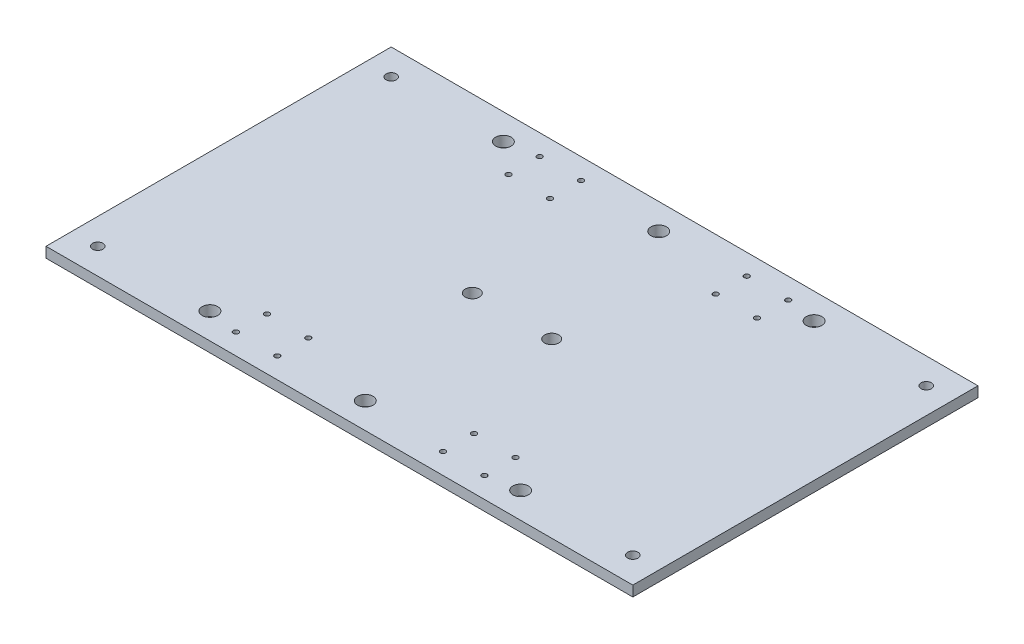
ISO-10303-21;
HEADER;
FILE_DESCRIPTION(('STEP AP214'),'2;1');
FILE_NAME('part.step','',(''),(''),'','','');
FILE_SCHEMA(('AUTOMOTIVE_DESIGN { 1 0 10303 214 1 1 1 1 }'));
ENDSEC;
DATA;
#1=APPLICATION_CONTEXT('core data for automotive mechanical design processes');
#2=APPLICATION_PROTOCOL_DEFINITION('international standard','automotive_design',2000,#1);
#3=PRODUCT_CONTEXT('',#1,'mechanical');
#4=PRODUCT('Part','Part','',(#3));
#5=PRODUCT_RELATED_PRODUCT_CATEGORY('part','',(#4));
#6=PRODUCT_DEFINITION_FORMATION('','',#4);
#7=PRODUCT_DEFINITION_CONTEXT('part definition',#1,'design');
#8=PRODUCT_DEFINITION('design','',#6,#7);
#9=PRODUCT_DEFINITION_SHAPE('','',#8);
#10=(LENGTH_UNIT() NAMED_UNIT(*) SI_UNIT(.MILLI.,.METRE.));
#11=(NAMED_UNIT(*) PLANE_ANGLE_UNIT() SI_UNIT($,.RADIAN.));
#12=(NAMED_UNIT(*) SI_UNIT($,.STERADIAN.) SOLID_ANGLE_UNIT());
#13=UNCERTAINTY_MEASURE_WITH_UNIT(LENGTH_MEASURE(1.E-05),#10,'distance_accuracy_value','');
#14=(GEOMETRIC_REPRESENTATION_CONTEXT(3) GLOBAL_UNCERTAINTY_ASSIGNED_CONTEXT((#13)) GLOBAL_UNIT_ASSIGNED_CONTEXT((#10,
#11,#12)) REPRESENTATION_CONTEXT('',''));
#15=CARTESIAN_POINT('',(0.,0.,0.));
#16=DIRECTION('',(0.,0.,1.));
#17=DIRECTION('',(1.,0.,0.));
#18=AXIS2_PLACEMENT_3D('',#15,#16,#17);
#19=CARTESIAN_POINT('',(0.,6.,0.));
#20=DIRECTION('',(0.,1.,0.));
#21=DIRECTION('',(0.,0.,1.));
#22=AXIS2_PLACEMENT_3D('',#19,#20,#21);
#23=PLANE('',#22);
#24=CARTESIAN_POINT('',(-90.,6.,85.));
#25=DIRECTION('',(0.,1.,0.));
#26=DIRECTION('',(0.,0.,1.));
#27=AXIS2_PLACEMENT_3D('',#24,#25,#26);
#28=CIRCLE('',#27,4.50000000000001);
#29=CARTESIAN_POINT('',(-90.,6.,89.5));
#30=VERTEX_POINT('',#29);
#31=EDGE_CURVE('E267',#30,#30,#28,.T.);
#32=ORIENTED_EDGE('',*,*,#31,.F.);
#33=EDGE_LOOP('',(#32));
#34=FACE_BOUND('',#33,.T.);
#35=CARTESIAN_POINT('',(90.,6.,-85.));
#36=DIRECTION('',(0.,1.,0.));
#37=DIRECTION('',(0.,0.,1.));
#38=AXIS2_PLACEMENT_3D('',#35,#36,#37);
#39=CIRCLE('',#38,4.50000000000001);
#40=CARTESIAN_POINT('',(90.,6.,-80.5));
#41=VERTEX_POINT('',#40);
#42=EDGE_CURVE('E255',#41,#41,#39,.T.);
#43=ORIENTED_EDGE('',*,*,#42,.F.);
#44=EDGE_LOOP('',(#43));
#45=FACE_BOUND('',#44,.T.);
#46=CARTESIAN_POINT('',(0.,6.,-85.));
#47=DIRECTION('',(0.,1.,0.));
#48=DIRECTION('',(0.,0.,1.));
#49=AXIS2_PLACEMENT_3D('',#46,#47,#48);
#50=CIRCLE('',#49,4.5);
#51=CARTESIAN_POINT('',(0.,6.,-80.5));
#52=VERTEX_POINT('',#51);
#53=EDGE_CURVE('E243',#52,#52,#50,.T.);
#54=ORIENTED_EDGE('',*,*,#53,.F.);
#55=EDGE_LOOP('',(#54));
#56=FACE_BOUND('',#55,.T.);
#57=CARTESIAN_POINT('',(155.,6.,85.));
#58=DIRECTION('',(0.,1.,0.));
#59=DIRECTION('',(0.,0.,-1.));
#60=AXIS2_PLACEMENT_3D('',#57,#58,#59);
#61=CIRCLE('',#60,2.99999999999999);
#62=CARTESIAN_POINT('',(155.,6.,82.));
#63=VERTEX_POINT('',#62);
#64=EDGE_CURVE('E231',#63,#63,#61,.T.);
#65=ORIENTED_EDGE('',*,*,#64,.F.);
#66=EDGE_LOOP('',(#65));
#67=FACE_BOUND('',#66,.T.);
#68=CARTESIAN_POINT('',(155.,6.,-85.));
#69=DIRECTION('',(0.,1.,0.));
#70=DIRECTION('',(0.,0.,1.));
#71=AXIS2_PLACEMENT_3D('',#68,#69,#70);
#72=CIRCLE('',#71,2.99999999999999);
#73=CARTESIAN_POINT('',(155.,6.,-82.));
#74=VERTEX_POINT('',#73);
#75=EDGE_CURVE('E219',#74,#74,#72,.T.);
#76=ORIENTED_EDGE('',*,*,#75,.F.);
#77=EDGE_LOOP('',(#76));
#78=FACE_BOUND('',#77,.T.);
#79=CARTESIAN_POINT('',(48.,6.,88.));
#80=DIRECTION('',(0.,1.,0.));
#81=DIRECTION('',(0.,0.,1.));
#82=AXIS2_PLACEMENT_3D('',#79,#80,#81);
#83=CIRCLE('',#82,1.49999999999333);
#84=CARTESIAN_POINT('',(48.,6.,89.4999999999933));
#85=VERTEX_POINT('',#84);
#86=EDGE_CURVE('E207',#85,#85,#83,.T.);
#87=ORIENTED_EDGE('',*,*,#86,.F.);
#88=EDGE_LOOP('',(#87));
#89=FACE_BOUND('',#88,.T.);
#90=CARTESIAN_POINT('',(48.0000000000002,6.,70.));
#91=DIRECTION('',(0.,1.,0.));
#92=DIRECTION('',(0.,0.,1.));
#93=AXIS2_PLACEMENT_3D('',#90,#91,#92);
#94=CIRCLE('',#93,1.49999999999333);
#95=CARTESIAN_POINT('',(48.0000000000002,6.,71.4999999999933));
#96=VERTEX_POINT('',#95);
#97=EDGE_CURVE('E195',#96,#96,#94,.T.);
#98=ORIENTED_EDGE('',*,*,#97,.F.);
#99=EDGE_LOOP('',(#98));
#100=FACE_BOUND('',#99,.T.);
#101=CARTESIAN_POINT('',(-72.0000000000007,6.,69.9999999999996));
#102=DIRECTION('',(0.,1.,0.));
#103=DIRECTION('',(0.,0.,1.));
#104=AXIS2_PLACEMENT_3D('',#101,#102,#103);
#105=CIRCLE('',#104,1.5);
#106=CARTESIAN_POINT('',(-72.0000000000007,6.,71.4999999999996));
#107=VERTEX_POINT('',#106);
#108=EDGE_CURVE('E183',#107,#107,#105,.T.);
#109=ORIENTED_EDGE('',*,*,#108,.F.);
#110=EDGE_LOOP('',(#109));
#111=FACE_BOUND('',#110,.T.);
#112=CARTESIAN_POINT('',(-72.0000000000006,6.,87.9999999999996));
#113=DIRECTION('',(0.,1.,0.));
#114=DIRECTION('',(0.,0.,1.));
#115=AXIS2_PLACEMENT_3D('',#112,#113,#114);
#116=CIRCLE('',#115,1.5);
#117=CARTESIAN_POINT('',(-72.0000000000006,6.,89.4999999999996));
#118=VERTEX_POINT('',#117);
#119=EDGE_CURVE('E171',#118,#118,#116,.T.);
#120=ORIENTED_EDGE('',*,*,#119,.F.);
#121=EDGE_LOOP('',(#120));
#122=FACE_BOUND('',#121,.T.);
#123=CARTESIAN_POINT('',(-48.0000000000006,6.,-87.9999999999996));
#124=DIRECTION('',(0.,1.,0.));
#125=DIRECTION('',(0.,0.,1.));
#126=AXIS2_PLACEMENT_3D('',#123,#124,#125);
#127=CIRCLE('',#126,1.49999999999332);
#128=CARTESIAN_POINT('',(-48.0000000000006,6.,-86.5000000000063));
#129=VERTEX_POINT('',#128);
#130=EDGE_CURVE('E159',#129,#129,#127,.T.);
#131=ORIENTED_EDGE('',*,*,#130,.F.);
#132=EDGE_LOOP('',(#131));
#133=FACE_BOUND('',#132,.T.);
#134=CARTESIAN_POINT('',(-48.0000000000007,6.,-69.9999999999996));
#135=DIRECTION('',(0.,1.,0.));
#136=DIRECTION('',(0.,0.,1.));
#137=AXIS2_PLACEMENT_3D('',#134,#135,#136);
#138=CIRCLE('',#137,1.49999999999332);
#139=CARTESIAN_POINT('',(-48.0000000000007,6.,-68.5000000000063));
#140=VERTEX_POINT('',#139);
#141=EDGE_CURVE('E147',#140,#140,#138,.T.);
#142=ORIENTED_EDGE('',*,*,#141,.F.);
#143=EDGE_LOOP('',(#142));
#144=FACE_BOUND('',#143,.T.);
#145=CARTESIAN_POINT('',(72.0000000000002,6.,-70.));
#146=DIRECTION('',(0.,1.,0.));
#147=DIRECTION('',(0.,0.,1.));
#148=AXIS2_PLACEMENT_3D('',#145,#146,#147);
#149=CIRCLE('',#148,1.5);
#150=CARTESIAN_POINT('',(72.0000000000002,6.,-68.5));
#151=VERTEX_POINT('',#150);
#152=EDGE_CURVE('E135',#151,#151,#149,.T.);
#153=ORIENTED_EDGE('',*,*,#152,.F.);
#154=EDGE_LOOP('',(#153));
#155=FACE_BOUND('',#154,.T.);
#156=CARTESIAN_POINT('',(72.,6.,-88.));
#157=DIRECTION('',(0.,1.,0.));
#158=DIRECTION('',(0.,0.,1.));
#159=AXIS2_PLACEMENT_3D('',#156,#157,#158);
#160=CIRCLE('',#159,1.5);
#161=CARTESIAN_POINT('',(72.,6.,-86.5));
#162=VERTEX_POINT('',#161);
#163=EDGE_CURVE('E123',#162,#162,#160,.T.);
#164=ORIENTED_EDGE('',*,*,#163,.F.);
#165=EDGE_LOOP('',(#164));
#166=FACE_BOUND('',#165,.T.);
#167=CARTESIAN_POINT('',(-23.,6.,0.));
#168=DIRECTION('',(0.,1.,0.));
#169=DIRECTION('',(0.,0.,1.));
#170=AXIS2_PLACEMENT_3D('',#167,#168,#169);
#171=CIRCLE('',#170,4.1);
#172=CARTESIAN_POINT('',(-23.,6.,4.1));
#173=VERTEX_POINT('',#172);
#174=EDGE_CURVE('E102',#173,#173,#171,.T.);
#175=ORIENTED_EDGE('',*,*,#174,.F.);
#176=EDGE_LOOP('',(#175));
#177=FACE_BOUND('',#176,.T.);
#178=DIRECTION('',(0.,0.,-1.));
#179=VECTOR('',#178,1.);
#180=CARTESIAN_POINT('',(170.,6.,-100.));
#181=LINE('',#180,#179);
#182=CARTESIAN_POINT('',(170.,6.,100.));
#183=VERTEX_POINT('',#182);
#184=CARTESIAN_POINT('',(170.,6.,-100.));
#185=VERTEX_POINT('',#184);
#186=EDGE_CURVE('E87',#183,#185,#181,.T.);
#187=ORIENTED_EDGE('',*,*,#186,.T.);
#188=DIRECTION('',(-1.,0.,0.));
#189=VECTOR('',#188,1.);
#190=CARTESIAN_POINT('',(-170.,6.,-100.));
#191=LINE('',#190,#189);
#192=CARTESIAN_POINT('',(-170.,6.,-100.));
#193=VERTEX_POINT('',#192);
#194=EDGE_CURVE('E82',#185,#193,#191,.T.);
#195=ORIENTED_EDGE('',*,*,#194,.T.);
#196=DIRECTION('',(0.,0.,1.));
#197=VECTOR('',#196,1.);
#198=CARTESIAN_POINT('',(-170.,6.,-100.));
#199=LINE('',#198,#197);
#200=CARTESIAN_POINT('',(-170.,6.,100.));
#201=VERTEX_POINT('',#200);
#202=EDGE_CURVE('E85',#193,#201,#199,.T.);
#203=ORIENTED_EDGE('',*,*,#202,.T.);
#204=DIRECTION('',(1.,0.,0.));
#205=VECTOR('',#204,1.);
#206=CARTESIAN_POINT('',(-170.,6.,100.));
#207=LINE('',#206,#205);
#208=EDGE_CURVE('E52',#201,#183,#207,.T.);
#209=ORIENTED_EDGE('',*,*,#208,.T.);
#210=EDGE_LOOP('',(#187,#195,#203,#209));
#211=FACE_BOUND('',#210,.T.);
#212=CARTESIAN_POINT('',(23.,6.,0.));
#213=DIRECTION('',(0.,1.,0.));
#214=DIRECTION('',(0.,0.,-1.));
#215=AXIS2_PLACEMENT_3D('',#212,#213,#214);
#216=CIRCLE('',#215,4.10000000000001);
#217=CARTESIAN_POINT('',(23.,6.,-4.10000000000001));
#218=VERTEX_POINT('',#217);
#219=EDGE_CURVE('E117',#218,#218,#216,.T.);
#220=ORIENTED_EDGE('',*,*,#219,.F.);
#221=EDGE_LOOP('',(#220));
#222=FACE_BOUND('',#221,.T.);
#223=CARTESIAN_POINT('',(48.,6.,-88.));
#224=DIRECTION('',(0.,1.,0.));
#225=DIRECTION('',(0.,0.,-1.));
#226=AXIS2_PLACEMENT_3D('',#223,#224,#225);
#227=CIRCLE('',#226,1.49999999999333);
#228=CARTESIAN_POINT('',(48.,6.,-89.4999999999933));
#229=VERTEX_POINT('',#228);
#230=EDGE_CURVE('E129',#229,#229,#227,.T.);
#231=ORIENTED_EDGE('',*,*,#230,.F.);
#232=EDGE_LOOP('',(#231));
#233=FACE_BOUND('',#232,.T.);
#234=CARTESIAN_POINT('',(48.0000000000002,6.,-70.));
#235=DIRECTION('',(0.,1.,0.));
#236=DIRECTION('',(0.,0.,-1.));
#237=AXIS2_PLACEMENT_3D('',#234,#235,#236);
#238=CIRCLE('',#237,1.49999999999333);
#239=CARTESIAN_POINT('',(48.0000000000002,6.,-71.4999999999933));
#240=VERTEX_POINT('',#239);
#241=EDGE_CURVE('E141',#240,#240,#238,.T.);
#242=ORIENTED_EDGE('',*,*,#241,.F.);
#243=EDGE_LOOP('',(#242));
#244=FACE_BOUND('',#243,.T.);
#245=CARTESIAN_POINT('',(-72.0000000000007,6.,-69.9999999999996));
#246=DIRECTION('',(0.,1.,0.));
#247=DIRECTION('',(0.,0.,-1.));
#248=AXIS2_PLACEMENT_3D('',#245,#246,#247);
#249=CIRCLE('',#248,1.5);
#250=CARTESIAN_POINT('',(-72.0000000000007,6.,-71.4999999999996));
#251=VERTEX_POINT('',#250);
#252=EDGE_CURVE('E153',#251,#251,#249,.T.);
#253=ORIENTED_EDGE('',*,*,#252,.F.);
#254=EDGE_LOOP('',(#253));
#255=FACE_BOUND('',#254,.T.);
#256=CARTESIAN_POINT('',(-72.0000000000006,6.,-87.9999999999996));
#257=DIRECTION('',(0.,1.,0.));
#258=DIRECTION('',(0.,0.,-1.));
#259=AXIS2_PLACEMENT_3D('',#256,#257,#258);
#260=CIRCLE('',#259,1.5);
#261=CARTESIAN_POINT('',(-72.0000000000006,6.,-89.4999999999996));
#262=VERTEX_POINT('',#261);
#263=EDGE_CURVE('E165',#262,#262,#260,.T.);
#264=ORIENTED_EDGE('',*,*,#263,.F.);
#265=EDGE_LOOP('',(#264));
#266=FACE_BOUND('',#265,.T.);
#267=CARTESIAN_POINT('',(-48.0000000000006,6.,87.9999999999996));
#268=DIRECTION('',(0.,1.,0.));
#269=DIRECTION('',(0.,0.,-1.));
#270=AXIS2_PLACEMENT_3D('',#267,#268,#269);
#271=CIRCLE('',#270,1.49999999999332);
#272=CARTESIAN_POINT('',(-48.0000000000006,6.,86.5000000000063));
#273=VERTEX_POINT('',#272);
#274=EDGE_CURVE('E177',#273,#273,#271,.T.);
#275=ORIENTED_EDGE('',*,*,#274,.F.);
#276=EDGE_LOOP('',(#275));
#277=FACE_BOUND('',#276,.T.);
#278=CARTESIAN_POINT('',(-48.0000000000007,6.,69.9999999999996));
#279=DIRECTION('',(0.,1.,0.));
#280=DIRECTION('',(0.,0.,-1.));
#281=AXIS2_PLACEMENT_3D('',#278,#279,#280);
#282=CIRCLE('',#281,1.49999999999332);
#283=CARTESIAN_POINT('',(-48.0000000000007,6.,68.5000000000063));
#284=VERTEX_POINT('',#283);
#285=EDGE_CURVE('E189',#284,#284,#282,.T.);
#286=ORIENTED_EDGE('',*,*,#285,.F.);
#287=EDGE_LOOP('',(#286));
#288=FACE_BOUND('',#287,.T.);
#289=CARTESIAN_POINT('',(72.0000000000002,6.,70.));
#290=DIRECTION('',(0.,1.,0.));
#291=DIRECTION('',(0.,0.,-1.));
#292=AXIS2_PLACEMENT_3D('',#289,#290,#291);
#293=CIRCLE('',#292,1.5);
#294=CARTESIAN_POINT('',(72.0000000000002,6.,68.5));
#295=VERTEX_POINT('',#294);
#296=EDGE_CURVE('E201',#295,#295,#293,.T.);
#297=ORIENTED_EDGE('',*,*,#296,.F.);
#298=EDGE_LOOP('',(#297));
#299=FACE_BOUND('',#298,.T.);
#300=CARTESIAN_POINT('',(72.,6.,88.));
#301=DIRECTION('',(0.,1.,0.));
#302=DIRECTION('',(0.,0.,-1.));
#303=AXIS2_PLACEMENT_3D('',#300,#301,#302);
#304=CIRCLE('',#303,1.5);
#305=CARTESIAN_POINT('',(72.,6.,86.5));
#306=VERTEX_POINT('',#305);
#307=EDGE_CURVE('E213',#306,#306,#304,.T.);
#308=ORIENTED_EDGE('',*,*,#307,.F.);
#309=EDGE_LOOP('',(#308));
#310=FACE_BOUND('',#309,.T.);
#311=CARTESIAN_POINT('',(-155.,6.,-85.));
#312=DIRECTION('',(0.,1.,0.));
#313=DIRECTION('',(0.,0.,-1.));
#314=AXIS2_PLACEMENT_3D('',#311,#312,#313);
#315=CIRCLE('',#314,2.99999999999999);
#316=CARTESIAN_POINT('',(-155.,6.,-88.));
#317=VERTEX_POINT('',#316);
#318=EDGE_CURVE('E225',#317,#317,#315,.T.);
#319=ORIENTED_EDGE('',*,*,#318,.F.);
#320=EDGE_LOOP('',(#319));
#321=FACE_BOUND('',#320,.T.);
#322=CARTESIAN_POINT('',(-155.,6.,85.));
#323=DIRECTION('',(0.,1.,0.));
#324=DIRECTION('',(0.,0.,1.));
#325=AXIS2_PLACEMENT_3D('',#322,#323,#324);
#326=CIRCLE('',#325,2.99999999999999);
#327=CARTESIAN_POINT('',(-155.,6.,88.));
#328=VERTEX_POINT('',#327);
#329=EDGE_CURVE('E237',#328,#328,#326,.T.);
#330=ORIENTED_EDGE('',*,*,#329,.F.);
#331=EDGE_LOOP('',(#330));
#332=FACE_BOUND('',#331,.T.);
#333=CARTESIAN_POINT('',(0.,6.,85.));
#334=DIRECTION('',(0.,1.,0.));
#335=DIRECTION('',(0.,0.,-1.));
#336=AXIS2_PLACEMENT_3D('',#333,#334,#335);
#337=CIRCLE('',#336,4.5);
#338=CARTESIAN_POINT('',(0.,6.,80.5));
#339=VERTEX_POINT('',#338);
#340=EDGE_CURVE('E249',#339,#339,#337,.T.);
#341=ORIENTED_EDGE('',*,*,#340,.F.);
#342=EDGE_LOOP('',(#341));
#343=FACE_BOUND('',#342,.T.);
#344=CARTESIAN_POINT('',(90.,6.,85.));
#345=DIRECTION('',(0.,1.,0.));
#346=DIRECTION('',(0.,0.,-1.));
#347=AXIS2_PLACEMENT_3D('',#344,#345,#346);
#348=CIRCLE('',#347,4.50000000000001);
#349=CARTESIAN_POINT('',(90.,6.,80.5));
#350=VERTEX_POINT('',#349);
#351=EDGE_CURVE('E261',#350,#350,#348,.T.);
#352=ORIENTED_EDGE('',*,*,#351,.F.);
#353=EDGE_LOOP('',(#352));
#354=FACE_BOUND('',#353,.T.);
#355=CARTESIAN_POINT('',(-90.,6.,-85.));
#356=DIRECTION('',(0.,1.,0.));
#357=DIRECTION('',(0.,0.,-1.));
#358=AXIS2_PLACEMENT_3D('',#355,#356,#357);
#359=CIRCLE('',#358,4.50000000000001);
#360=CARTESIAN_POINT('',(-90.,6.,-89.5));
#361=VERTEX_POINT('',#360);
#362=EDGE_CURVE('E273',#361,#361,#359,.T.);
#363=ORIENTED_EDGE('',*,*,#362,.F.);
#364=EDGE_LOOP('',(#363));
#365=FACE_BOUND('',#364,.T.);
#366=ADVANCED_FACE('F35',(#34,#45,#56,#67,#78,#89,#100,#111,#122,#133,#144,#155,#166,#177,#211,
#222,#233,#244,#255,#266,#277,#288,#299,#310,#321,#332,#343,#354,#365),#23,.T.);
#367=CARTESIAN_POINT('',(0.,0.,0.));
#368=DIRECTION('',(0.,1.,0.));
#369=DIRECTION('',(0.,0.,1.));
#370=AXIS2_PLACEMENT_3D('',#367,#368,#369);
#371=PLANE('',#370);
#372=DIRECTION('',(0.,0.,-1.));
#373=VECTOR('',#372,1.);
#374=CARTESIAN_POINT('',(170.,0.,-100.));
#375=LINE('',#374,#373);
#376=CARTESIAN_POINT('',(170.,0.,100.));
#377=VERTEX_POINT('',#376);
#378=CARTESIAN_POINT('',(170.,0.,-100.));
#379=VERTEX_POINT('',#378);
#380=EDGE_CURVE('E99',#377,#379,#375,.T.);
#381=ORIENTED_EDGE('',*,*,#380,.F.);
#382=DIRECTION('',(1.,0.,0.));
#383=VECTOR('',#382,1.);
#384=CARTESIAN_POINT('',(-170.,0.,100.));
#385=LINE('',#384,#383);
#386=CARTESIAN_POINT('',(-170.,0.,100.));
#387=VERTEX_POINT('',#386);
#388=EDGE_CURVE('E75',#387,#377,#385,.T.);
#389=ORIENTED_EDGE('',*,*,#388,.F.);
#390=DIRECTION('',(0.,0.,1.));
#391=VECTOR('',#390,1.);
#392=CARTESIAN_POINT('',(-170.,0.,-100.));
#393=LINE('',#392,#391);
#394=CARTESIAN_POINT('',(-170.,0.,-100.));
#395=VERTEX_POINT('',#394);
#396=EDGE_CURVE('E69',#395,#387,#393,.T.);
#397=ORIENTED_EDGE('',*,*,#396,.F.);
#398=DIRECTION('',(-1.,0.,0.));
#399=VECTOR('',#398,1.);
#400=CARTESIAN_POINT('',(-170.,0.,-100.));
#401=LINE('',#400,#399);
#402=EDGE_CURVE('E91',#379,#395,#401,.T.);
#403=ORIENTED_EDGE('',*,*,#402,.F.);
#404=EDGE_LOOP('',(#381,#389,#397,#403));
#405=FACE_BOUND('',#404,.T.);
#406=CARTESIAN_POINT('',(-23.,0.,0.));
#407=DIRECTION('',(0.,1.,0.));
#408=DIRECTION('',(0.,0.,1.));
#409=AXIS2_PLACEMENT_3D('',#406,#407,#408);
#410=CIRCLE('',#409,4.1);
#411=CARTESIAN_POINT('',(-23.,0.,4.1));
#412=VERTEX_POINT('',#411);
#413=EDGE_CURVE('E114',#412,#412,#410,.T.);
#414=ORIENTED_EDGE('',*,*,#413,.T.);
#415=EDGE_LOOP('',(#414));
#416=FACE_BOUND('',#415,.T.);
#417=CARTESIAN_POINT('',(23.,0.,0.));
#418=DIRECTION('',(0.,1.,0.));
#419=DIRECTION('',(0.,0.,-1.));
#420=AXIS2_PLACEMENT_3D('',#417,#418,#419);
#421=CIRCLE('',#420,4.10000000000001);
#422=CARTESIAN_POINT('',(23.,0.,-4.10000000000001));
#423=VERTEX_POINT('',#422);
#424=EDGE_CURVE('E120',#423,#423,#421,.T.);
#425=ORIENTED_EDGE('',*,*,#424,.T.);
#426=EDGE_LOOP('',(#425));
#427=FACE_BOUND('',#426,.T.);
#428=CARTESIAN_POINT('',(72.,0.,-88.));
#429=DIRECTION('',(0.,1.,0.));
#430=DIRECTION('',(0.,0.,1.));
#431=AXIS2_PLACEMENT_3D('',#428,#429,#430);
#432=CIRCLE('',#431,1.5);
#433=CARTESIAN_POINT('',(72.,0.,-86.5));
#434=VERTEX_POINT('',#433);
#435=EDGE_CURVE('E126',#434,#434,#432,.T.);
#436=ORIENTED_EDGE('',*,*,#435,.T.);
#437=EDGE_LOOP('',(#436));
#438=FACE_BOUND('',#437,.T.);
#439=CARTESIAN_POINT('',(48.,0.,-88.));
#440=DIRECTION('',(0.,1.,0.));
#441=DIRECTION('',(0.,0.,-1.));
#442=AXIS2_PLACEMENT_3D('',#439,#440,#441);
#443=CIRCLE('',#442,1.49999999999333);
#444=CARTESIAN_POINT('',(48.,0.,-89.4999999999933));
#445=VERTEX_POINT('',#444);
#446=EDGE_CURVE('E132',#445,#445,#443,.T.);
#447=ORIENTED_EDGE('',*,*,#446,.T.);
#448=EDGE_LOOP('',(#447));
#449=FACE_BOUND('',#448,.T.);
#450=CARTESIAN_POINT('',(72.0000000000002,0.,-70.));
#451=DIRECTION('',(0.,1.,0.));
#452=DIRECTION('',(0.,0.,1.));
#453=AXIS2_PLACEMENT_3D('',#450,#451,#452);
#454=CIRCLE('',#453,1.5);
#455=CARTESIAN_POINT('',(72.0000000000002,0.,-68.5));
#456=VERTEX_POINT('',#455);
#457=EDGE_CURVE('E138',#456,#456,#454,.T.);
#458=ORIENTED_EDGE('',*,*,#457,.T.);
#459=EDGE_LOOP('',(#458));
#460=FACE_BOUND('',#459,.T.);
#461=CARTESIAN_POINT('',(48.0000000000002,0.,-70.));
#462=DIRECTION('',(0.,1.,0.));
#463=DIRECTION('',(0.,0.,-1.));
#464=AXIS2_PLACEMENT_3D('',#461,#462,#463);
#465=CIRCLE('',#464,1.49999999999333);
#466=CARTESIAN_POINT('',(48.0000000000002,0.,-71.4999999999933));
#467=VERTEX_POINT('',#466);
#468=EDGE_CURVE('E144',#467,#467,#465,.T.);
#469=ORIENTED_EDGE('',*,*,#468,.T.);
#470=EDGE_LOOP('',(#469));
#471=FACE_BOUND('',#470,.T.);
#472=CARTESIAN_POINT('',(-48.0000000000007,0.,-69.9999999999996));
#473=DIRECTION('',(0.,1.,0.));
#474=DIRECTION('',(0.,0.,1.));
#475=AXIS2_PLACEMENT_3D('',#472,#473,#474);
#476=CIRCLE('',#475,1.49999999999332);
#477=CARTESIAN_POINT('',(-48.0000000000007,0.,-68.5000000000063));
#478=VERTEX_POINT('',#477);
#479=EDGE_CURVE('E150',#478,#478,#476,.T.);
#480=ORIENTED_EDGE('',*,*,#479,.T.);
#481=EDGE_LOOP('',(#480));
#482=FACE_BOUND('',#481,.T.);
#483=CARTESIAN_POINT('',(-72.0000000000007,0.,-69.9999999999996));
#484=DIRECTION('',(0.,1.,0.));
#485=DIRECTION('',(0.,0.,-1.));
#486=AXIS2_PLACEMENT_3D('',#483,#484,#485);
#487=CIRCLE('',#486,1.5);
#488=CARTESIAN_POINT('',(-72.0000000000007,0.,-71.4999999999996));
#489=VERTEX_POINT('',#488);
#490=EDGE_CURVE('E156',#489,#489,#487,.T.);
#491=ORIENTED_EDGE('',*,*,#490,.T.);
#492=EDGE_LOOP('',(#491));
#493=FACE_BOUND('',#492,.T.);
#494=CARTESIAN_POINT('',(-48.0000000000006,0.,-87.9999999999996));
#495=DIRECTION('',(0.,1.,0.));
#496=DIRECTION('',(0.,0.,1.));
#497=AXIS2_PLACEMENT_3D('',#494,#495,#496);
#498=CIRCLE('',#497,1.49999999999332);
#499=CARTESIAN_POINT('',(-48.0000000000006,0.,-86.5000000000063));
#500=VERTEX_POINT('',#499);
#501=EDGE_CURVE('E162',#500,#500,#498,.T.);
#502=ORIENTED_EDGE('',*,*,#501,.T.);
#503=EDGE_LOOP('',(#502));
#504=FACE_BOUND('',#503,.T.);
#505=CARTESIAN_POINT('',(-72.0000000000006,0.,-87.9999999999996));
#506=DIRECTION('',(0.,1.,0.));
#507=DIRECTION('',(0.,0.,-1.));
#508=AXIS2_PLACEMENT_3D('',#505,#506,#507);
#509=CIRCLE('',#508,1.5);
#510=CARTESIAN_POINT('',(-72.0000000000006,0.,-89.4999999999996));
#511=VERTEX_POINT('',#510);
#512=EDGE_CURVE('E168',#511,#511,#509,.T.);
#513=ORIENTED_EDGE('',*,*,#512,.T.);
#514=EDGE_LOOP('',(#513));
#515=FACE_BOUND('',#514,.T.);
#516=CARTESIAN_POINT('',(-72.0000000000006,0.,87.9999999999996));
#517=DIRECTION('',(0.,1.,0.));
#518=DIRECTION('',(0.,0.,1.));
#519=AXIS2_PLACEMENT_3D('',#516,#517,#518);
#520=CIRCLE('',#519,1.5);
#521=CARTESIAN_POINT('',(-72.0000000000006,0.,89.4999999999996));
#522=VERTEX_POINT('',#521);
#523=EDGE_CURVE('E174',#522,#522,#520,.T.);
#524=ORIENTED_EDGE('',*,*,#523,.T.);
#525=EDGE_LOOP('',(#524));
#526=FACE_BOUND('',#525,.T.);
#527=CARTESIAN_POINT('',(-48.0000000000006,0.,87.9999999999996));
#528=DIRECTION('',(0.,1.,0.));
#529=DIRECTION('',(0.,0.,-1.));
#530=AXIS2_PLACEMENT_3D('',#527,#528,#529);
#531=CIRCLE('',#530,1.49999999999332);
#532=CARTESIAN_POINT('',(-48.0000000000006,0.,86.5000000000063));
#533=VERTEX_POINT('',#532);
#534=EDGE_CURVE('E180',#533,#533,#531,.T.);
#535=ORIENTED_EDGE('',*,*,#534,.T.);
#536=EDGE_LOOP('',(#535));
#537=FACE_BOUND('',#536,.T.);
#538=CARTESIAN_POINT('',(-72.0000000000007,0.,69.9999999999996));
#539=DIRECTION('',(0.,1.,0.));
#540=DIRECTION('',(0.,0.,1.));
#541=AXIS2_PLACEMENT_3D('',#538,#539,#540);
#542=CIRCLE('',#541,1.5);
#543=CARTESIAN_POINT('',(-72.0000000000007,0.,71.4999999999996));
#544=VERTEX_POINT('',#543);
#545=EDGE_CURVE('E186',#544,#544,#542,.T.);
#546=ORIENTED_EDGE('',*,*,#545,.T.);
#547=EDGE_LOOP('',(#546));
#548=FACE_BOUND('',#547,.T.);
#549=CARTESIAN_POINT('',(-48.0000000000007,0.,69.9999999999996));
#550=DIRECTION('',(0.,1.,0.));
#551=DIRECTION('',(0.,0.,-1.));
#552=AXIS2_PLACEMENT_3D('',#549,#550,#551);
#553=CIRCLE('',#552,1.49999999999332);
#554=CARTESIAN_POINT('',(-48.0000000000007,0.,68.5000000000063));
#555=VERTEX_POINT('',#554);
#556=EDGE_CURVE('E192',#555,#555,#553,.T.);
#557=ORIENTED_EDGE('',*,*,#556,.T.);
#558=EDGE_LOOP('',(#557));
#559=FACE_BOUND('',#558,.T.);
#560=CARTESIAN_POINT('',(48.0000000000002,0.,70.));
#561=DIRECTION('',(0.,1.,0.));
#562=DIRECTION('',(0.,0.,1.));
#563=AXIS2_PLACEMENT_3D('',#560,#561,#562);
#564=CIRCLE('',#563,1.49999999999333);
#565=CARTESIAN_POINT('',(48.0000000000002,0.,71.4999999999933));
#566=VERTEX_POINT('',#565);
#567=EDGE_CURVE('E198',#566,#566,#564,.T.);
#568=ORIENTED_EDGE('',*,*,#567,.T.);
#569=EDGE_LOOP('',(#568));
#570=FACE_BOUND('',#569,.T.);
#571=CARTESIAN_POINT('',(72.0000000000002,0.,70.));
#572=DIRECTION('',(0.,1.,0.));
#573=DIRECTION('',(0.,0.,-1.));
#574=AXIS2_PLACEMENT_3D('',#571,#572,#573);
#575=CIRCLE('',#574,1.5);
#576=CARTESIAN_POINT('',(72.0000000000002,0.,68.5));
#577=VERTEX_POINT('',#576);
#578=EDGE_CURVE('E204',#577,#577,#575,.T.);
#579=ORIENTED_EDGE('',*,*,#578,.T.);
#580=EDGE_LOOP('',(#579));
#581=FACE_BOUND('',#580,.T.);
#582=CARTESIAN_POINT('',(48.,0.,88.));
#583=DIRECTION('',(0.,1.,0.));
#584=DIRECTION('',(0.,0.,1.));
#585=AXIS2_PLACEMENT_3D('',#582,#583,#584);
#586=CIRCLE('',#585,1.49999999999333);
#587=CARTESIAN_POINT('',(48.,0.,89.4999999999933));
#588=VERTEX_POINT('',#587);
#589=EDGE_CURVE('E210',#588,#588,#586,.T.);
#590=ORIENTED_EDGE('',*,*,#589,.T.);
#591=EDGE_LOOP('',(#590));
#592=FACE_BOUND('',#591,.T.);
#593=CARTESIAN_POINT('',(72.,0.,88.));
#594=DIRECTION('',(0.,1.,0.));
#595=DIRECTION('',(0.,0.,-1.));
#596=AXIS2_PLACEMENT_3D('',#593,#594,#595);
#597=CIRCLE('',#596,1.5);
#598=CARTESIAN_POINT('',(72.,0.,86.5));
#599=VERTEX_POINT('',#598);
#600=EDGE_CURVE('E216',#599,#599,#597,.T.);
#601=ORIENTED_EDGE('',*,*,#600,.T.);
#602=EDGE_LOOP('',(#601));
#603=FACE_BOUND('',#602,.T.);
#604=CARTESIAN_POINT('',(155.,0.,-85.));
#605=DIRECTION('',(0.,1.,0.));
#606=DIRECTION('',(0.,0.,1.));
#607=AXIS2_PLACEMENT_3D('',#604,#605,#606);
#608=CIRCLE('',#607,2.99999999999999);
#609=CARTESIAN_POINT('',(155.,0.,-82.));
#610=VERTEX_POINT('',#609);
#611=EDGE_CURVE('E222',#610,#610,#608,.T.);
#612=ORIENTED_EDGE('',*,*,#611,.T.);
#613=EDGE_LOOP('',(#612));
#614=FACE_BOUND('',#613,.T.);
#615=CARTESIAN_POINT('',(-155.,0.,-85.));
#616=DIRECTION('',(0.,1.,0.));
#617=DIRECTION('',(0.,0.,-1.));
#618=AXIS2_PLACEMENT_3D('',#615,#616,#617);
#619=CIRCLE('',#618,2.99999999999999);
#620=CARTESIAN_POINT('',(-155.,0.,-88.));
#621=VERTEX_POINT('',#620);
#622=EDGE_CURVE('E228',#621,#621,#619,.T.);
#623=ORIENTED_EDGE('',*,*,#622,.T.);
#624=EDGE_LOOP('',(#623));
#625=FACE_BOUND('',#624,.T.);
#626=CARTESIAN_POINT('',(155.,0.,85.));
#627=DIRECTION('',(0.,1.,0.));
#628=DIRECTION('',(0.,0.,-1.));
#629=AXIS2_PLACEMENT_3D('',#626,#627,#628);
#630=CIRCLE('',#629,2.99999999999999);
#631=CARTESIAN_POINT('',(155.,0.,82.));
#632=VERTEX_POINT('',#631);
#633=EDGE_CURVE('E234',#632,#632,#630,.T.);
#634=ORIENTED_EDGE('',*,*,#633,.T.);
#635=EDGE_LOOP('',(#634));
#636=FACE_BOUND('',#635,.T.);
#637=CARTESIAN_POINT('',(-155.,0.,85.));
#638=DIRECTION('',(0.,1.,0.));
#639=DIRECTION('',(0.,0.,1.));
#640=AXIS2_PLACEMENT_3D('',#637,#638,#639);
#641=CIRCLE('',#640,2.99999999999999);
#642=CARTESIAN_POINT('',(-155.,0.,88.));
#643=VERTEX_POINT('',#642);
#644=EDGE_CURVE('E240',#643,#643,#641,.T.);
#645=ORIENTED_EDGE('',*,*,#644,.T.);
#646=EDGE_LOOP('',(#645));
#647=FACE_BOUND('',#646,.T.);
#648=CARTESIAN_POINT('',(0.,0.,-85.));
#649=DIRECTION('',(0.,1.,0.));
#650=DIRECTION('',(0.,0.,1.));
#651=AXIS2_PLACEMENT_3D('',#648,#649,#650);
#652=CIRCLE('',#651,4.5);
#653=CARTESIAN_POINT('',(0.,0.,-80.5));
#654=VERTEX_POINT('',#653);
#655=EDGE_CURVE('E246',#654,#654,#652,.T.);
#656=ORIENTED_EDGE('',*,*,#655,.T.);
#657=EDGE_LOOP('',(#656));
#658=FACE_BOUND('',#657,.T.);
#659=CARTESIAN_POINT('',(0.,0.,85.));
#660=DIRECTION('',(0.,1.,0.));
#661=DIRECTION('',(0.,0.,-1.));
#662=AXIS2_PLACEMENT_3D('',#659,#660,#661);
#663=CIRCLE('',#662,4.5);
#664=CARTESIAN_POINT('',(0.,0.,80.5));
#665=VERTEX_POINT('',#664);
#666=EDGE_CURVE('E252',#665,#665,#663,.T.);
#667=ORIENTED_EDGE('',*,*,#666,.T.);
#668=EDGE_LOOP('',(#667));
#669=FACE_BOUND('',#668,.T.);
#670=CARTESIAN_POINT('',(90.,0.,-85.));
#671=DIRECTION('',(0.,1.,0.));
#672=DIRECTION('',(0.,0.,1.));
#673=AXIS2_PLACEMENT_3D('',#670,#671,#672);
#674=CIRCLE('',#673,4.50000000000001);
#675=CARTESIAN_POINT('',(90.,0.,-80.5));
#676=VERTEX_POINT('',#675);
#677=EDGE_CURVE('E258',#676,#676,#674,.T.);
#678=ORIENTED_EDGE('',*,*,#677,.T.);
#679=EDGE_LOOP('',(#678));
#680=FACE_BOUND('',#679,.T.);
#681=CARTESIAN_POINT('',(90.,0.,85.));
#682=DIRECTION('',(0.,1.,0.));
#683=DIRECTION('',(0.,0.,-1.));
#684=AXIS2_PLACEMENT_3D('',#681,#682,#683);
#685=CIRCLE('',#684,4.50000000000001);
#686=CARTESIAN_POINT('',(90.,0.,80.5));
#687=VERTEX_POINT('',#686);
#688=EDGE_CURVE('E264',#687,#687,#685,.T.);
#689=ORIENTED_EDGE('',*,*,#688,.T.);
#690=EDGE_LOOP('',(#689));
#691=FACE_BOUND('',#690,.T.);
#692=CARTESIAN_POINT('',(-90.,0.,85.));
#693=DIRECTION('',(0.,1.,0.));
#694=DIRECTION('',(0.,0.,1.));
#695=AXIS2_PLACEMENT_3D('',#692,#693,#694);
#696=CIRCLE('',#695,4.50000000000001);
#697=CARTESIAN_POINT('',(-90.,0.,89.5));
#698=VERTEX_POINT('',#697);
#699=EDGE_CURVE('E270',#698,#698,#696,.T.);
#700=ORIENTED_EDGE('',*,*,#699,.T.);
#701=EDGE_LOOP('',(#700));
#702=FACE_BOUND('',#701,.T.);
#703=CARTESIAN_POINT('',(-90.,0.,-85.));
#704=DIRECTION('',(0.,1.,0.));
#705=DIRECTION('',(0.,0.,-1.));
#706=AXIS2_PLACEMENT_3D('',#703,#704,#705);
#707=CIRCLE('',#706,4.50000000000001);
#708=CARTESIAN_POINT('',(-90.,0.,-89.5));
#709=VERTEX_POINT('',#708);
#710=EDGE_CURVE('E276',#709,#709,#707,.T.);
#711=ORIENTED_EDGE('',*,*,#710,.T.);
#712=EDGE_LOOP('',(#711));
#713=FACE_BOUND('',#712,.T.);
#714=ADVANCED_FACE('F110',(#405,#416,#427,#438,#449,#460,#471,#482,#493,#504,#515,#526,#537,
#548,#559,#570,#581,#592,#603,#614,#625,#636,#647,#658,#669,#680,#691,#702,#713),#371,.F.);
#715=CARTESIAN_POINT('',(170.,6.,-100.));
#716=DIRECTION('',(-1.,0.,0.));
#717=DIRECTION('',(0.,0.,1.));
#718=AXIS2_PLACEMENT_3D('',#715,#716,#717);
#719=PLANE('',#718);
#720=ORIENTED_EDGE('',*,*,#380,.T.);
#721=DIRECTION('',(0.,-1.,0.));
#722=VECTOR('',#721,1.);
#723=CARTESIAN_POINT('',(170.,6.,-100.));
#724=LINE('',#723,#722);
#725=EDGE_CURVE('E11',#185,#379,#724,.T.);
#726=ORIENTED_EDGE('',*,*,#725,.F.);
#727=ORIENTED_EDGE('',*,*,#186,.F.);
#728=DIRECTION('',(0.,-1.,0.));
#729=VECTOR('',#728,1.);
#730=CARTESIAN_POINT('',(170.,6.,100.));
#731=LINE('',#730,#729);
#732=EDGE_CURVE('E95',#183,#377,#731,.T.);
#733=ORIENTED_EDGE('',*,*,#732,.T.);
#734=EDGE_LOOP('',(#720,#726,#727,#733));
#735=FACE_BOUND('',#734,.T.);
#736=ADVANCED_FACE('F37',(#735),#719,.F.);
#737=CARTESIAN_POINT('',(-170.,6.,-100.));
#738=DIRECTION('',(0.,0.,1.));
#739=DIRECTION('',(1.,0.,0.));
#740=AXIS2_PLACEMENT_3D('',#737,#738,#739);
#741=PLANE('',#740);
#742=ORIENTED_EDGE('',*,*,#402,.T.);
#743=DIRECTION('',(0.,-1.,0.));
#744=VECTOR('',#743,1.);
#745=CARTESIAN_POINT('',(-170.,6.,-100.));
#746=LINE('',#745,#744);
#747=EDGE_CURVE('E44',#193,#395,#746,.T.);
#748=ORIENTED_EDGE('',*,*,#747,.F.);
#749=ORIENTED_EDGE('',*,*,#194,.F.);
#750=ORIENTED_EDGE('',*,*,#725,.T.);
#751=EDGE_LOOP('',(#742,#748,#749,#750));
#752=FACE_BOUND('',#751,.T.);
#753=ADVANCED_FACE('F90',(#752),#741,.F.);
#754=CARTESIAN_POINT('',(-170.,6.,-100.));
#755=DIRECTION('',(1.,0.,0.));
#756=DIRECTION('',(0.,0.,-1.));
#757=AXIS2_PLACEMENT_3D('',#754,#755,#756);
#758=PLANE('',#757);
#759=ORIENTED_EDGE('',*,*,#396,.T.);
#760=DIRECTION('',(0.,-1.,0.));
#761=VECTOR('',#760,1.);
#762=CARTESIAN_POINT('',(-170.,6.,100.));
#763=LINE('',#762,#761);
#764=EDGE_CURVE('E92',#201,#387,#763,.T.);
#765=ORIENTED_EDGE('',*,*,#764,.F.);
#766=ORIENTED_EDGE('',*,*,#202,.F.);
#767=ORIENTED_EDGE('',*,*,#747,.T.);
#768=EDGE_LOOP('',(#759,#765,#766,#767));
#769=FACE_BOUND('',#768,.T.);
#770=ADVANCED_FACE('F93',(#769),#758,.F.);
#771=CARTESIAN_POINT('',(-170.,6.,100.));
#772=DIRECTION('',(0.,0.,-1.));
#773=DIRECTION('',(-1.,0.,0.));
#774=AXIS2_PLACEMENT_3D('',#771,#772,#773);
#775=PLANE('',#774);
#776=ORIENTED_EDGE('',*,*,#388,.T.);
#777=ORIENTED_EDGE('',*,*,#732,.F.);
#778=ORIENTED_EDGE('',*,*,#208,.F.);
#779=ORIENTED_EDGE('',*,*,#764,.T.);
#780=EDGE_LOOP('',(#776,#777,#778,#779));
#781=FACE_BOUND('',#780,.T.);
#782=ADVANCED_FACE('F107',(#781),#775,.F.);
#783=CARTESIAN_POINT('',(-23.,6.,0.));
#784=DIRECTION('',(0.,-1.,0.));
#785=DIRECTION('',(0.,0.,-1.));
#786=AXIS2_PLACEMENT_3D('',#783,#784,#785);
#787=CYLINDRICAL_SURFACE('',#786,4.1);
#788=ORIENTED_EDGE('',*,*,#174,.T.);
#789=EDGE_LOOP('',(#788));
#790=FACE_BOUND('',#789,.T.);
#791=ORIENTED_EDGE('',*,*,#413,.F.);
#792=EDGE_LOOP('',(#791));
#793=FACE_BOUND('',#792,.T.);
#794=ADVANCED_FACE('F295',(#790,#793),#787,.F.);
#795=CARTESIAN_POINT('',(23.,6.,0.));
#796=DIRECTION('',(0.,-1.,0.));
#797=DIRECTION('',(0.,0.,-1.));
#798=AXIS2_PLACEMENT_3D('',#795,#796,#797);
#799=CYLINDRICAL_SURFACE('',#798,4.10000000000001);
#800=ORIENTED_EDGE('',*,*,#219,.T.);
#801=EDGE_LOOP('',(#800));
#802=FACE_BOUND('',#801,.T.);
#803=ORIENTED_EDGE('',*,*,#424,.F.);
#804=EDGE_LOOP('',(#803));
#805=FACE_BOUND('',#804,.T.);
#806=ADVANCED_FACE('F341',(#802,#805),#799,.F.);
#807=CARTESIAN_POINT('',(72.,6.,-88.));
#808=DIRECTION('',(0.,-1.,0.));
#809=DIRECTION('',(0.,0.,-1.));
#810=AXIS2_PLACEMENT_3D('',#807,#808,#809);
#811=CYLINDRICAL_SURFACE('',#810,1.5);
#812=ORIENTED_EDGE('',*,*,#163,.T.);
#813=EDGE_LOOP('',(#812));
#814=FACE_BOUND('',#813,.T.);
#815=ORIENTED_EDGE('',*,*,#435,.F.);
#816=EDGE_LOOP('',(#815));
#817=FACE_BOUND('',#816,.T.);
#818=ADVANCED_FACE('F349',(#814,#817),#811,.F.);
#819=CARTESIAN_POINT('',(48.,6.,-88.));
#820=DIRECTION('',(0.,-1.,0.));
#821=DIRECTION('',(0.,0.,-1.));
#822=AXIS2_PLACEMENT_3D('',#819,#820,#821);
#823=CYLINDRICAL_SURFACE('',#822,1.49999999999333);
#824=ORIENTED_EDGE('',*,*,#230,.T.);
#825=EDGE_LOOP('',(#824));
#826=FACE_BOUND('',#825,.T.);
#827=ORIENTED_EDGE('',*,*,#446,.F.);
#828=EDGE_LOOP('',(#827));
#829=FACE_BOUND('',#828,.T.);
#830=ADVANCED_FACE('F357',(#826,#829),#823,.F.);
#831=CARTESIAN_POINT('',(72.0000000000002,6.,-70.));
#832=DIRECTION('',(0.,-1.,0.));
#833=DIRECTION('',(0.,0.,-1.));
#834=AXIS2_PLACEMENT_3D('',#831,#832,#833);
#835=CYLINDRICAL_SURFACE('',#834,1.5);
#836=ORIENTED_EDGE('',*,*,#152,.T.);
#837=EDGE_LOOP('',(#836));
#838=FACE_BOUND('',#837,.T.);
#839=ORIENTED_EDGE('',*,*,#457,.F.);
#840=EDGE_LOOP('',(#839));
#841=FACE_BOUND('',#840,.T.);
#842=ADVANCED_FACE('F366',(#838,#841),#835,.F.);
#843=CARTESIAN_POINT('',(48.0000000000002,6.,-70.));
#844=DIRECTION('',(0.,-1.,0.));
#845=DIRECTION('',(0.,0.,-1.));
#846=AXIS2_PLACEMENT_3D('',#843,#844,#845);
#847=CYLINDRICAL_SURFACE('',#846,1.49999999999333);
#848=ORIENTED_EDGE('',*,*,#241,.T.);
#849=EDGE_LOOP('',(#848));
#850=FACE_BOUND('',#849,.T.);
#851=ORIENTED_EDGE('',*,*,#468,.F.);
#852=EDGE_LOOP('',(#851));
#853=FACE_BOUND('',#852,.T.);
#854=ADVANCED_FACE('F375',(#850,#853),#847,.F.);
#855=CARTESIAN_POINT('',(-48.0000000000007,6.,-69.9999999999996));
#856=DIRECTION('',(0.,-1.,0.));
#857=DIRECTION('',(0.,0.,-1.));
#858=AXIS2_PLACEMENT_3D('',#855,#856,#857);
#859=CYLINDRICAL_SURFACE('',#858,1.49999999999332);
#860=ORIENTED_EDGE('',*,*,#141,.T.);
#861=EDGE_LOOP('',(#860));
#862=FACE_BOUND('',#861,.T.);
#863=ORIENTED_EDGE('',*,*,#479,.F.);
#864=EDGE_LOOP('',(#863));
#865=FACE_BOUND('',#864,.T.);
#866=ADVANCED_FACE('F384',(#862,#865),#859,.F.);
#867=CARTESIAN_POINT('',(-72.0000000000007,6.,-69.9999999999996));
#868=DIRECTION('',(0.,-1.,0.));
#869=DIRECTION('',(0.,0.,-1.));
#870=AXIS2_PLACEMENT_3D('',#867,#868,#869);
#871=CYLINDRICAL_SURFACE('',#870,1.5);
#872=ORIENTED_EDGE('',*,*,#252,.T.);
#873=EDGE_LOOP('',(#872));
#874=FACE_BOUND('',#873,.T.);
#875=ORIENTED_EDGE('',*,*,#490,.F.);
#876=EDGE_LOOP('',(#875));
#877=FACE_BOUND('',#876,.T.);
#878=ADVANCED_FACE('F393',(#874,#877),#871,.F.);
#879=CARTESIAN_POINT('',(-48.0000000000006,6.,-87.9999999999996));
#880=DIRECTION('',(0.,-1.,0.));
#881=DIRECTION('',(0.,0.,-1.));
#882=AXIS2_PLACEMENT_3D('',#879,#880,#881);
#883=CYLINDRICAL_SURFACE('',#882,1.49999999999332);
#884=ORIENTED_EDGE('',*,*,#130,.T.);
#885=EDGE_LOOP('',(#884));
#886=FACE_BOUND('',#885,.T.);
#887=ORIENTED_EDGE('',*,*,#501,.F.);
#888=EDGE_LOOP('',(#887));
#889=FACE_BOUND('',#888,.T.);
#890=ADVANCED_FACE('F402',(#886,#889),#883,.F.);
#891=CARTESIAN_POINT('',(-72.0000000000006,6.,-87.9999999999996));
#892=DIRECTION('',(0.,-1.,0.));
#893=DIRECTION('',(0.,0.,-1.));
#894=AXIS2_PLACEMENT_3D('',#891,#892,#893);
#895=CYLINDRICAL_SURFACE('',#894,1.5);
#896=ORIENTED_EDGE('',*,*,#263,.T.);
#897=EDGE_LOOP('',(#896));
#898=FACE_BOUND('',#897,.T.);
#899=ORIENTED_EDGE('',*,*,#512,.F.);
#900=EDGE_LOOP('',(#899));
#901=FACE_BOUND('',#900,.T.);
#902=ADVANCED_FACE('F411',(#898,#901),#895,.F.);
#903=CARTESIAN_POINT('',(-72.0000000000006,6.,87.9999999999996));
#904=DIRECTION('',(0.,-1.,0.));
#905=DIRECTION('',(0.,0.,-1.));
#906=AXIS2_PLACEMENT_3D('',#903,#904,#905);
#907=CYLINDRICAL_SURFACE('',#906,1.5);
#908=ORIENTED_EDGE('',*,*,#119,.T.);
#909=EDGE_LOOP('',(#908));
#910=FACE_BOUND('',#909,.T.);
#911=ORIENTED_EDGE('',*,*,#523,.F.);
#912=EDGE_LOOP('',(#911));
#913=FACE_BOUND('',#912,.T.);
#914=ADVANCED_FACE('F420',(#910,#913),#907,.F.);
#915=CARTESIAN_POINT('',(-48.0000000000006,6.,87.9999999999996));
#916=DIRECTION('',(0.,-1.,0.));
#917=DIRECTION('',(0.,0.,-1.));
#918=AXIS2_PLACEMENT_3D('',#915,#916,#917);
#919=CYLINDRICAL_SURFACE('',#918,1.49999999999332);
#920=ORIENTED_EDGE('',*,*,#274,.T.);
#921=EDGE_LOOP('',(#920));
#922=FACE_BOUND('',#921,.T.);
#923=ORIENTED_EDGE('',*,*,#534,.F.);
#924=EDGE_LOOP('',(#923));
#925=FACE_BOUND('',#924,.T.);
#926=ADVANCED_FACE('F429',(#922,#925),#919,.F.);
#927=CARTESIAN_POINT('',(-72.0000000000007,6.,69.9999999999996));
#928=DIRECTION('',(0.,-1.,0.));
#929=DIRECTION('',(0.,0.,-1.));
#930=AXIS2_PLACEMENT_3D('',#927,#928,#929);
#931=CYLINDRICAL_SURFACE('',#930,1.5);
#932=ORIENTED_EDGE('',*,*,#108,.T.);
#933=EDGE_LOOP('',(#932));
#934=FACE_BOUND('',#933,.T.);
#935=ORIENTED_EDGE('',*,*,#545,.F.);
#936=EDGE_LOOP('',(#935));
#937=FACE_BOUND('',#936,.T.);
#938=ADVANCED_FACE('F438',(#934,#937),#931,.F.);
#939=CARTESIAN_POINT('',(-48.0000000000007,6.,69.9999999999996));
#940=DIRECTION('',(0.,-1.,0.));
#941=DIRECTION('',(0.,0.,-1.));
#942=AXIS2_PLACEMENT_3D('',#939,#940,#941);
#943=CYLINDRICAL_SURFACE('',#942,1.49999999999332);
#944=ORIENTED_EDGE('',*,*,#285,.T.);
#945=EDGE_LOOP('',(#944));
#946=FACE_BOUND('',#945,.T.);
#947=ORIENTED_EDGE('',*,*,#556,.F.);
#948=EDGE_LOOP('',(#947));
#949=FACE_BOUND('',#948,.T.);
#950=ADVANCED_FACE('F447',(#946,#949),#943,.F.);
#951=CARTESIAN_POINT('',(48.0000000000002,6.,70.));
#952=DIRECTION('',(0.,-1.,0.));
#953=DIRECTION('',(0.,0.,-1.));
#954=AXIS2_PLACEMENT_3D('',#951,#952,#953);
#955=CYLINDRICAL_SURFACE('',#954,1.49999999999333);
#956=ORIENTED_EDGE('',*,*,#97,.T.);
#957=EDGE_LOOP('',(#956));
#958=FACE_BOUND('',#957,.T.);
#959=ORIENTED_EDGE('',*,*,#567,.F.);
#960=EDGE_LOOP('',(#959));
#961=FACE_BOUND('',#960,.T.);
#962=ADVANCED_FACE('F456',(#958,#961),#955,.F.);
#963=CARTESIAN_POINT('',(72.0000000000002,6.,70.));
#964=DIRECTION('',(0.,-1.,0.));
#965=DIRECTION('',(0.,0.,-1.));
#966=AXIS2_PLACEMENT_3D('',#963,#964,#965);
#967=CYLINDRICAL_SURFACE('',#966,1.5);
#968=ORIENTED_EDGE('',*,*,#296,.T.);
#969=EDGE_LOOP('',(#968));
#970=FACE_BOUND('',#969,.T.);
#971=ORIENTED_EDGE('',*,*,#578,.F.);
#972=EDGE_LOOP('',(#971));
#973=FACE_BOUND('',#972,.T.);
#974=ADVANCED_FACE('F465',(#970,#973),#967,.F.);
#975=CARTESIAN_POINT('',(48.,6.,88.));
#976=DIRECTION('',(0.,-1.,0.));
#977=DIRECTION('',(0.,0.,-1.));
#978=AXIS2_PLACEMENT_3D('',#975,#976,#977);
#979=CYLINDRICAL_SURFACE('',#978,1.49999999999333);
#980=ORIENTED_EDGE('',*,*,#86,.T.);
#981=EDGE_LOOP('',(#980));
#982=FACE_BOUND('',#981,.T.);
#983=ORIENTED_EDGE('',*,*,#589,.F.);
#984=EDGE_LOOP('',(#983));
#985=FACE_BOUND('',#984,.T.);
#986=ADVANCED_FACE('F474',(#982,#985),#979,.F.);
#987=CARTESIAN_POINT('',(72.,6.,88.));
#988=DIRECTION('',(0.,-1.,0.));
#989=DIRECTION('',(0.,0.,-1.));
#990=AXIS2_PLACEMENT_3D('',#987,#988,#989);
#991=CYLINDRICAL_SURFACE('',#990,1.5);
#992=ORIENTED_EDGE('',*,*,#307,.T.);
#993=EDGE_LOOP('',(#992));
#994=FACE_BOUND('',#993,.T.);
#995=ORIENTED_EDGE('',*,*,#600,.F.);
#996=EDGE_LOOP('',(#995));
#997=FACE_BOUND('',#996,.T.);
#998=ADVANCED_FACE('F483',(#994,#997),#991,.F.);
#999=CARTESIAN_POINT('',(155.,6.,-85.));
#1000=DIRECTION('',(0.,-1.,0.));
#1001=DIRECTION('',(0.,0.,-1.));
#1002=AXIS2_PLACEMENT_3D('',#999,#1000,#1001);
#1003=CYLINDRICAL_SURFACE('',#1002,2.99999999999999);
#1004=ORIENTED_EDGE('',*,*,#75,.T.);
#1005=EDGE_LOOP('',(#1004));
#1006=FACE_BOUND('',#1005,.T.);
#1007=ORIENTED_EDGE('',*,*,#611,.F.);
#1008=EDGE_LOOP('',(#1007));
#1009=FACE_BOUND('',#1008,.T.);
#1010=ADVANCED_FACE('F492',(#1006,#1009),#1003,.F.);
#1011=CARTESIAN_POINT('',(-155.,6.,-85.));
#1012=DIRECTION('',(0.,-1.,0.));
#1013=DIRECTION('',(0.,0.,-1.));
#1014=AXIS2_PLACEMENT_3D('',#1011,#1012,#1013);
#1015=CYLINDRICAL_SURFACE('',#1014,2.99999999999999);
#1016=ORIENTED_EDGE('',*,*,#318,.T.);
#1017=EDGE_LOOP('',(#1016));
#1018=FACE_BOUND('',#1017,.T.);
#1019=ORIENTED_EDGE('',*,*,#622,.F.);
#1020=EDGE_LOOP('',(#1019));
#1021=FACE_BOUND('',#1020,.T.);
#1022=ADVANCED_FACE('F501',(#1018,#1021),#1015,.F.);
#1023=CARTESIAN_POINT('',(155.,6.,85.));
#1024=DIRECTION('',(0.,-1.,0.));
#1025=DIRECTION('',(0.,0.,-1.));
#1026=AXIS2_PLACEMENT_3D('',#1023,#1024,#1025);
#1027=CYLINDRICAL_SURFACE('',#1026,2.99999999999999);
#1028=ORIENTED_EDGE('',*,*,#64,.T.);
#1029=EDGE_LOOP('',(#1028));
#1030=FACE_BOUND('',#1029,.T.);
#1031=ORIENTED_EDGE('',*,*,#633,.F.);
#1032=EDGE_LOOP('',(#1031));
#1033=FACE_BOUND('',#1032,.T.);
#1034=ADVANCED_FACE('F510',(#1030,#1033),#1027,.F.);
#1035=CARTESIAN_POINT('',(-155.,6.,85.));
#1036=DIRECTION('',(0.,-1.,0.));
#1037=DIRECTION('',(0.,0.,-1.));
#1038=AXIS2_PLACEMENT_3D('',#1035,#1036,#1037);
#1039=CYLINDRICAL_SURFACE('',#1038,2.99999999999999);
#1040=ORIENTED_EDGE('',*,*,#329,.T.);
#1041=EDGE_LOOP('',(#1040));
#1042=FACE_BOUND('',#1041,.T.);
#1043=ORIENTED_EDGE('',*,*,#644,.F.);
#1044=EDGE_LOOP('',(#1043));
#1045=FACE_BOUND('',#1044,.T.);
#1046=ADVANCED_FACE('F519',(#1042,#1045),#1039,.F.);
#1047=CARTESIAN_POINT('',(0.,6.,-85.));
#1048=DIRECTION('',(0.,-1.,0.));
#1049=DIRECTION('',(0.,0.,-1.));
#1050=AXIS2_PLACEMENT_3D('',#1047,#1048,#1049);
#1051=CYLINDRICAL_SURFACE('',#1050,4.5);
#1052=ORIENTED_EDGE('',*,*,#53,.T.);
#1053=EDGE_LOOP('',(#1052));
#1054=FACE_BOUND('',#1053,.T.);
#1055=ORIENTED_EDGE('',*,*,#655,.F.);
#1056=EDGE_LOOP('',(#1055));
#1057=FACE_BOUND('',#1056,.T.);
#1058=ADVANCED_FACE('F528',(#1054,#1057),#1051,.F.);
#1059=CARTESIAN_POINT('',(0.,6.,85.));
#1060=DIRECTION('',(0.,-1.,0.));
#1061=DIRECTION('',(0.,0.,-1.));
#1062=AXIS2_PLACEMENT_3D('',#1059,#1060,#1061);
#1063=CYLINDRICAL_SURFACE('',#1062,4.5);
#1064=ORIENTED_EDGE('',*,*,#340,.T.);
#1065=EDGE_LOOP('',(#1064));
#1066=FACE_BOUND('',#1065,.T.);
#1067=ORIENTED_EDGE('',*,*,#666,.F.);
#1068=EDGE_LOOP('',(#1067));
#1069=FACE_BOUND('',#1068,.T.);
#1070=ADVANCED_FACE('F537',(#1066,#1069),#1063,.F.);
#1071=CARTESIAN_POINT('',(90.,6.,-85.));
#1072=DIRECTION('',(0.,-1.,0.));
#1073=DIRECTION('',(0.,0.,-1.));
#1074=AXIS2_PLACEMENT_3D('',#1071,#1072,#1073);
#1075=CYLINDRICAL_SURFACE('',#1074,4.50000000000001);
#1076=ORIENTED_EDGE('',*,*,#42,.T.);
#1077=EDGE_LOOP('',(#1076));
#1078=FACE_BOUND('',#1077,.T.);
#1079=ORIENTED_EDGE('',*,*,#677,.F.);
#1080=EDGE_LOOP('',(#1079));
#1081=FACE_BOUND('',#1080,.T.);
#1082=ADVANCED_FACE('F546',(#1078,#1081),#1075,.F.);
#1083=CARTESIAN_POINT('',(90.,6.,85.));
#1084=DIRECTION('',(0.,-1.,0.));
#1085=DIRECTION('',(0.,0.,-1.));
#1086=AXIS2_PLACEMENT_3D('',#1083,#1084,#1085);
#1087=CYLINDRICAL_SURFACE('',#1086,4.50000000000001);
#1088=ORIENTED_EDGE('',*,*,#351,.T.);
#1089=EDGE_LOOP('',(#1088));
#1090=FACE_BOUND('',#1089,.T.);
#1091=ORIENTED_EDGE('',*,*,#688,.F.);
#1092=EDGE_LOOP('',(#1091));
#1093=FACE_BOUND('',#1092,.T.);
#1094=ADVANCED_FACE('F555',(#1090,#1093),#1087,.F.);
#1095=CARTESIAN_POINT('',(-90.,6.,85.));
#1096=DIRECTION('',(0.,-1.,0.));
#1097=DIRECTION('',(0.,0.,-1.));
#1098=AXIS2_PLACEMENT_3D('',#1095,#1096,#1097);
#1099=CYLINDRICAL_SURFACE('',#1098,4.50000000000001);
#1100=ORIENTED_EDGE('',*,*,#31,.T.);
#1101=EDGE_LOOP('',(#1100));
#1102=FACE_BOUND('',#1101,.T.);
#1103=ORIENTED_EDGE('',*,*,#699,.F.);
#1104=EDGE_LOOP('',(#1103));
#1105=FACE_BOUND('',#1104,.T.);
#1106=ADVANCED_FACE('F564',(#1102,#1105),#1099,.F.);
#1107=CARTESIAN_POINT('',(-90.,6.,-85.));
#1108=DIRECTION('',(0.,-1.,0.));
#1109=DIRECTION('',(0.,0.,-1.));
#1110=AXIS2_PLACEMENT_3D('',#1107,#1108,#1109);
#1111=CYLINDRICAL_SURFACE('',#1110,4.50000000000001);
#1112=ORIENTED_EDGE('',*,*,#362,.T.);
#1113=EDGE_LOOP('',(#1112));
#1114=FACE_BOUND('',#1113,.T.);
#1115=ORIENTED_EDGE('',*,*,#710,.F.);
#1116=EDGE_LOOP('',(#1115));
#1117=FACE_BOUND('',#1116,.T.);
#1118=ADVANCED_FACE('F282',(#1114,#1117),#1111,.F.);
#1119=CLOSED_SHELL('',(#366,#714,#736,#753,#770,#782,#794,#806,#818,#830,#842,#854,#866,#878,
#890,#902,#914,#926,#938,#950,#962,#974,#986,#998,#1010,#1022,#1034,#1046,#1058,#1070,#1082,
#1094,#1106,#1118));
#1120=MANIFOLD_SOLID_BREP('B2',#1119);
#1121=ADVANCED_BREP_SHAPE_REPRESENTATION('',(#18,#1120),#14);
#1122=SHAPE_DEFINITION_REPRESENTATION(#9,#1121);
ENDSEC;
END-ISO-10303-21;
